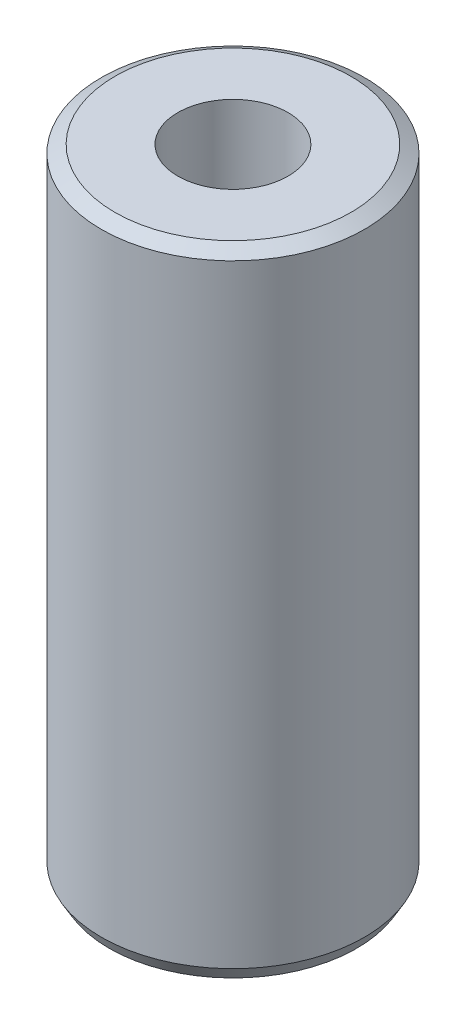
ISO-10303-21;
HEADER;
FILE_DESCRIPTION(('STEP AP214'),'2;1');
FILE_NAME('part.step','',(''),(''),'','','');
FILE_SCHEMA(('AUTOMOTIVE_DESIGN { 1 0 10303 214 1 1 1 1 }'));
ENDSEC;
DATA;
#1=APPLICATION_CONTEXT('core data for automotive mechanical design processes');
#2=APPLICATION_PROTOCOL_DEFINITION('international standard','automotive_design',2000,#1);
#3=PRODUCT_CONTEXT('',#1,'mechanical');
#4=PRODUCT('Part','Part','',(#3));
#5=PRODUCT_RELATED_PRODUCT_CATEGORY('part','',(#4));
#6=PRODUCT_DEFINITION_FORMATION('','',#4);
#7=PRODUCT_DEFINITION_CONTEXT('part definition',#1,'design');
#8=PRODUCT_DEFINITION('design','',#6,#7);
#9=PRODUCT_DEFINITION_SHAPE('','',#8);
#10=(LENGTH_UNIT() NAMED_UNIT(*) SI_UNIT(.MILLI.,.METRE.));
#11=(NAMED_UNIT(*) PLANE_ANGLE_UNIT() SI_UNIT($,.RADIAN.));
#12=(NAMED_UNIT(*) SI_UNIT($,.STERADIAN.) SOLID_ANGLE_UNIT());
#13=UNCERTAINTY_MEASURE_WITH_UNIT(LENGTH_MEASURE(1.E-05),#10,'distance_accuracy_value','');
#14=(GEOMETRIC_REPRESENTATION_CONTEXT(3) GLOBAL_UNCERTAINTY_ASSIGNED_CONTEXT((#13)) GLOBAL_UNIT_ASSIGNED_CONTEXT((#10,
#11,#12)) REPRESENTATION_CONTEXT('',''));
#15=CARTESIAN_POINT('',(0.,0.,0.));
#16=DIRECTION('',(0.,0.,1.));
#17=DIRECTION('',(1.,0.,0.));
#18=AXIS2_PLACEMENT_3D('',#15,#16,#17);
#19=CARTESIAN_POINT('',(0.,241.08413209631,0.));
#20=DIRECTION('',(0.,-1.,0.));
#21=DIRECTION('',(0.,0.,-1.));
#22=AXIS2_PLACEMENT_3D('',#19,#20,#21);
#23=CYLINDRICAL_SURFACE('',#22,50.);
#24=CARTESIAN_POINT('',(0.,238.097529150767,0.));
#25=DIRECTION('',(0.,1.,0.));
#26=DIRECTION('',(0.,0.,1.));
#27=AXIS2_PLACEMENT_3D('',#24,#25,#26);
#28=CIRCLE('',#27,50.);
#29=CARTESIAN_POINT('',(0.,238.097529150767,50.));
#30=VERTEX_POINT('',#29);
#31=EDGE_CURVE('E50',#30,#30,#28,.F.);
#32=ORIENTED_EDGE('',*,*,#31,.T.);
#33=EDGE_LOOP('',(#32));
#34=FACE_BOUND('',#33,.T.);
#35=CARTESIAN_POINT('',(0.,5.17294804371637,0.));
#36=DIRECTION('',(0.,1.,0.));
#37=DIRECTION('',(0.,0.,1.));
#38=AXIS2_PLACEMENT_3D('',#35,#36,#37);
#39=CIRCLE('',#38,50.);
#40=CARTESIAN_POINT('',(0.,5.17294804371637,50.));
#41=VERTEX_POINT('',#40);
#42=EDGE_CURVE('E51',#41,#41,#39,.T.);
#43=ORIENTED_EDGE('',*,*,#42,.T.);
#44=EDGE_LOOP('',(#43));
#45=FACE_BOUND('',#44,.T.);
#46=ADVANCED_FACE('F39',(#34,#45),#23,.T.);
#47=CARTESIAN_POINT('',(0.,241.08413209631,0.));
#48=DIRECTION('',(0.,1.,0.));
#49=DIRECTION('',(0.,0.,1.));
#50=AXIS2_PLACEMENT_3D('',#47,#48,#49);
#51=PLANE('',#50);
#52=CARTESIAN_POINT('',(0.,241.08413209631,0.));
#53=DIRECTION('',(0.,1.,0.));
#54=DIRECTION('',(0.,0.,1.));
#55=AXIS2_PLACEMENT_3D('',#52,#53,#54);
#56=CIRCLE('',#55,44.8270519562837);
#57=CARTESIAN_POINT('',(0.,241.08413209631,44.8270519562837));
#58=VERTEX_POINT('',#57);
#59=EDGE_CURVE('E54',#58,#58,#56,.T.);
#60=ORIENTED_EDGE('',*,*,#59,.T.);
#61=EDGE_LOOP('',(#60));
#62=FACE_BOUND('',#61,.T.);
#63=CARTESIAN_POINT('',(0.,241.08413209631,0.));
#64=DIRECTION('',(0.,1.,0.));
#65=DIRECTION('',(0.,0.,1.));
#66=AXIS2_PLACEMENT_3D('',#63,#64,#65);
#67=CIRCLE('',#66,20.9532448886061);
#68=CARTESIAN_POINT('',(0.,241.08413209631,20.9532448886061));
#69=VERTEX_POINT('',#68);
#70=EDGE_CURVE('E58',#69,#69,#67,.T.);
#71=ORIENTED_EDGE('',*,*,#70,.F.);
#72=EDGE_LOOP('',(#71));
#73=FACE_BOUND('',#72,.T.);
#74=ADVANCED_FACE('F69',(#62,#73),#51,.T.);
#75=CARTESIAN_POINT('',(0.,0.,0.));
#76=DIRECTION('',(0.,1.,0.));
#77=DIRECTION('',(0.,0.,1.));
#78=AXIS2_PLACEMENT_3D('',#75,#76,#77);
#79=PLANE('',#78);
#80=CARTESIAN_POINT('',(0.,0.,0.));
#81=DIRECTION('',(0.,1.,0.));
#82=DIRECTION('',(0.,0.,1.));
#83=AXIS2_PLACEMENT_3D('',#80,#81,#82);
#84=CIRCLE('',#83,47.0133970544564);
#85=CARTESIAN_POINT('',(0.,0.,47.0133970544564));
#86=VERTEX_POINT('',#85);
#87=EDGE_CURVE('E10',#86,#86,#84,.F.);
#88=ORIENTED_EDGE('',*,*,#87,.T.);
#89=EDGE_LOOP('',(#88));
#90=FACE_BOUND('',#89,.T.);
#91=CARTESIAN_POINT('',(0.,0.,0.));
#92=DIRECTION('',(0.,1.,0.));
#93=DIRECTION('',(0.,0.,1.));
#94=AXIS2_PLACEMENT_3D('',#91,#92,#93);
#95=CIRCLE('',#94,20.9532448886061);
#96=CARTESIAN_POINT('',(0.,0.,20.9532448886061));
#97=VERTEX_POINT('',#96);
#98=EDGE_CURVE('E63',#97,#97,#95,.T.);
#99=ORIENTED_EDGE('',*,*,#98,.T.);
#100=EDGE_LOOP('',(#99));
#101=FACE_BOUND('',#100,.T.);
#102=ADVANCED_FACE('F75',(#90,#101),#79,.F.);
#103=CARTESIAN_POINT('',(0.,241.08413209631,0.));
#104=DIRECTION('',(0.,-1.,0.));
#105=DIRECTION('',(0.,0.,-1.));
#106=AXIS2_PLACEMENT_3D('',#103,#104,#105);
#107=CYLINDRICAL_SURFACE('',#106,20.9532448886061);
#108=ORIENTED_EDGE('',*,*,#70,.T.);
#109=EDGE_LOOP('',(#108));
#110=FACE_BOUND('',#109,.T.);
#111=ORIENTED_EDGE('',*,*,#98,.F.);
#112=EDGE_LOOP('',(#111));
#113=FACE_BOUND('',#112,.T.);
#114=ADVANCED_FACE('F70',(#110,#113),#107,.F.);
#115=CARTESIAN_POINT('',(0.,241.08413209631,0.));
#116=DIRECTION('',(0.,-1.,0.));
#117=DIRECTION('',(0.,0.,-1.));
#118=AXIS2_PLACEMENT_3D('',#115,#116,#117);
#119=CONICAL_SURFACE('',#118,44.8270519562837,1.04719755119659);
#120=ORIENTED_EDGE('',*,*,#31,.F.);
#121=EDGE_LOOP('',(#120));
#122=FACE_BOUND('',#121,.T.);
#123=ORIENTED_EDGE('',*,*,#59,.F.);
#124=EDGE_LOOP('',(#123));
#125=FACE_BOUND('',#124,.T.);
#126=ADVANCED_FACE('F81',(#122,#125),#119,.T.);
#127=CARTESIAN_POINT('',(0.,5.17294804371637,0.));
#128=DIRECTION('',(0.,1.,0.));
#129=DIRECTION('',(0.,0.,1.));
#130=AXIS2_PLACEMENT_3D('',#127,#128,#129);
#131=CONICAL_SURFACE('',#130,50.,0.523598775598306);
#132=ORIENTED_EDGE('',*,*,#87,.F.);
#133=EDGE_LOOP('',(#132));
#134=FACE_BOUND('',#133,.T.);
#135=ORIENTED_EDGE('',*,*,#42,.F.);
#136=EDGE_LOOP('',(#135));
#137=FACE_BOUND('',#136,.T.);
#138=ADVANCED_FACE('F45',(#134,#137),#131,.T.);
#139=CLOSED_SHELL('',(#46,#74,#102,#114,#126,#138));
#140=MANIFOLD_SOLID_BREP('B2',#139);
#141=ADVANCED_BREP_SHAPE_REPRESENTATION('',(#18,#140),#14);
#142=SHAPE_DEFINITION_REPRESENTATION(#9,#141);
ENDSEC;
END-ISO-10303-21;
